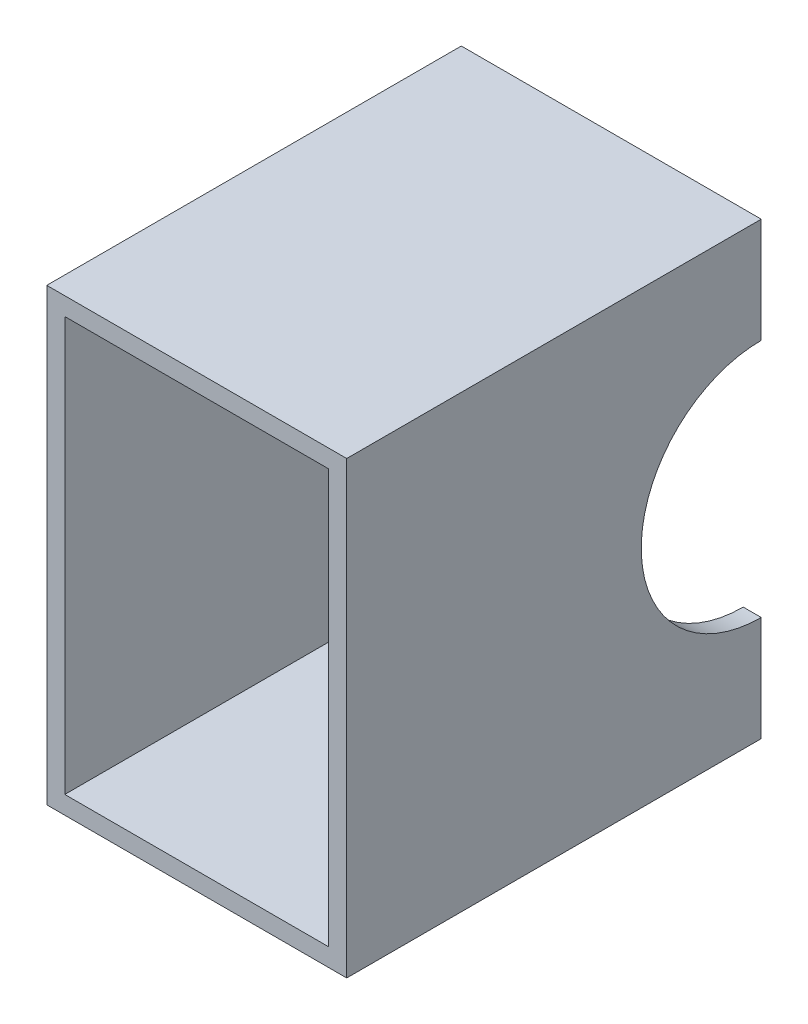
ISO-10303-21;
HEADER;
FILE_DESCRIPTION(('STEP AP214'),'2;1');
FILE_NAME('part.step','',(''),(''),'','','');
FILE_SCHEMA(('AUTOMOTIVE_DESIGN { 1 0 10303 214 1 1 1 1 }'));
ENDSEC;
DATA;
#1=APPLICATION_CONTEXT('core data for automotive mechanical design processes');
#2=APPLICATION_PROTOCOL_DEFINITION('international standard','automotive_design',2000,#1);
#3=PRODUCT_CONTEXT('',#1,'mechanical');
#4=PRODUCT('Part','Part','',(#3));
#5=PRODUCT_RELATED_PRODUCT_CATEGORY('part','',(#4));
#6=PRODUCT_DEFINITION_FORMATION('','',#4);
#7=PRODUCT_DEFINITION_CONTEXT('part definition',#1,'design');
#8=PRODUCT_DEFINITION('design','',#6,#7);
#9=PRODUCT_DEFINITION_SHAPE('','',#8);
#10=(LENGTH_UNIT() NAMED_UNIT(*) SI_UNIT(.MILLI.,.METRE.));
#11=(NAMED_UNIT(*) PLANE_ANGLE_UNIT() SI_UNIT($,.RADIAN.));
#12=(NAMED_UNIT(*) SI_UNIT($,.STERADIAN.) SOLID_ANGLE_UNIT());
#13=UNCERTAINTY_MEASURE_WITH_UNIT(LENGTH_MEASURE(1.E-05),#10,'distance_accuracy_value','');
#14=(GEOMETRIC_REPRESENTATION_CONTEXT(3) GLOBAL_UNCERTAINTY_ASSIGNED_CONTEXT((#13)) GLOBAL_UNIT_ASSIGNED_CONTEXT((#10,
#11,#12)) REPRESENTATION_CONTEXT('',''));
#15=CARTESIAN_POINT('',(0.,0.,0.));
#16=DIRECTION('',(0.,0.,1.));
#17=DIRECTION('',(1.,0.,0.));
#18=AXIS2_PLACEMENT_3D('',#15,#16,#17);
#19=CARTESIAN_POINT('',(0.,0.,0.));
#20=DIRECTION('',(0.,0.,-1.));
#21=DIRECTION('',(-1.,0.,0.));
#22=AXIS2_PLACEMENT_3D('',#19,#20,#21);
#23=PLANE('',#22);
#24=DIRECTION('',(1.,0.,0.));
#25=VECTOR('',#24,1.);
#26=CARTESIAN_POINT('',(-50.,40.,0.));
#27=LINE('',#26,#25);
#28=CARTESIAN_POINT('',(-50.,40.,0.));
#29=VERTEX_POINT('',#28);
#30=CARTESIAN_POINT('',(-44.,40.,0.));
#31=VERTEX_POINT('',#30);
#32=EDGE_CURVE('E53',#29,#31,#27,.T.);
#33=ORIENTED_EDGE('',*,*,#32,.F.);
#34=DIRECTION('',(0.,-1.,0.));
#35=VECTOR('',#34,1.);
#36=CARTESIAN_POINT('',(-50.,-75.,0.));
#37=LINE('',#36,#35);
#38=CARTESIAN_POINT('',(-50.,74.9999999999999,0.));
#39=VERTEX_POINT('',#38);
#40=EDGE_CURVE('E138',#39,#29,#37,.T.);
#41=ORIENTED_EDGE('',*,*,#40,.F.);
#42=DIRECTION('',(-1.,0.,0.));
#43=VECTOR('',#42,1.);
#44=CARTESIAN_POINT('',(-50.,74.9999999999999,0.));
#45=LINE('',#44,#43);
#46=CARTESIAN_POINT('',(50.,75.,0.));
#47=VERTEX_POINT('',#46);
#48=EDGE_CURVE('E161',#47,#39,#45,.T.);
#49=ORIENTED_EDGE('',*,*,#48,.F.);
#50=DIRECTION('',(0.,1.,0.));
#51=VECTOR('',#50,1.);
#52=CARTESIAN_POINT('',(50.,-75.,0.));
#53=LINE('',#52,#51);
#54=CARTESIAN_POINT('',(50.,40.,0.));
#55=VERTEX_POINT('',#54);
#56=EDGE_CURVE('E151',#55,#47,#53,.T.);
#57=ORIENTED_EDGE('',*,*,#56,.F.);
#58=CARTESIAN_POINT('',(44.,40.,0.));
#59=VERTEX_POINT('',#58);
#60=EDGE_CURVE('E141',#59,#55,#27,.T.);
#61=ORIENTED_EDGE('',*,*,#60,.F.);
#62=DIRECTION('',(0.,1.,0.));
#63=VECTOR('',#62,1.);
#64=CARTESIAN_POINT('',(44.,-69.,0.));
#65=LINE('',#64,#63);
#66=CARTESIAN_POINT('',(44.,69.,0.));
#67=VERTEX_POINT('',#66);
#68=EDGE_CURVE('E209',#59,#67,#65,.T.);
#69=ORIENTED_EDGE('',*,*,#68,.T.);
#70=DIRECTION('',(-1.,0.,0.));
#71=VECTOR('',#70,1.);
#72=CARTESIAN_POINT('',(-44.,69.,0.));
#73=LINE('',#72,#71);
#74=CARTESIAN_POINT('',(-44.,69.,0.));
#75=VERTEX_POINT('',#74);
#76=EDGE_CURVE('E202',#67,#75,#73,.T.);
#77=ORIENTED_EDGE('',*,*,#76,.T.);
#78=DIRECTION('',(0.,-1.,0.));
#79=VECTOR('',#78,1.);
#80=CARTESIAN_POINT('',(-44.,-69.,0.));
#81=LINE('',#80,#79);
#82=EDGE_CURVE('E136',#75,#31,#81,.T.);
#83=ORIENTED_EDGE('',*,*,#82,.T.);
#84=EDGE_LOOP('',(#33,#41,#49,#57,#61,#69,#77,#83));
#85=FACE_BOUND('',#84,.T.);
#86=ADVANCED_FACE('F39',(#85),#23,.T.);
#87=CARTESIAN_POINT('',(0.,0.,138.202315188089));
#88=DIRECTION('',(0.,0.,-1.));
#89=DIRECTION('',(-1.,0.,0.));
#90=AXIS2_PLACEMENT_3D('',#87,#88,#89);
#91=PLANE('',#90);
#92=DIRECTION('',(0.,-1.,0.));
#93=VECTOR('',#92,1.);
#94=CARTESIAN_POINT('',(-50.,-75.,138.202315188089));
#95=LINE('',#94,#93);
#96=CARTESIAN_POINT('',(-50.,74.9999999999999,138.202315188089));
#97=VERTEX_POINT('',#96);
#98=CARTESIAN_POINT('',(-50.,-75.,138.202315188089));
#99=VERTEX_POINT('',#98);
#100=EDGE_CURVE('E162',#97,#99,#95,.T.);
#101=ORIENTED_EDGE('',*,*,#100,.T.);
#102=DIRECTION('',(1.,0.,0.));
#103=VECTOR('',#102,1.);
#104=CARTESIAN_POINT('',(-50.,-75.,138.202315188089));
#105=LINE('',#104,#103);
#106=CARTESIAN_POINT('',(50.,-75.,138.202315188089));
#107=VERTEX_POINT('',#106);
#108=EDGE_CURVE('E177',#99,#107,#105,.T.);
#109=ORIENTED_EDGE('',*,*,#108,.T.);
#110=DIRECTION('',(0.,1.,0.));
#111=VECTOR('',#110,1.);
#112=CARTESIAN_POINT('',(50.,-75.,138.202315188089));
#113=LINE('',#112,#111);
#114=CARTESIAN_POINT('',(50.,75.,138.202315188089));
#115=VERTEX_POINT('',#114);
#116=EDGE_CURVE('E190',#107,#115,#113,.T.);
#117=ORIENTED_EDGE('',*,*,#116,.T.);
#118=DIRECTION('',(-1.,0.,0.));
#119=VECTOR('',#118,1.);
#120=CARTESIAN_POINT('',(-50.,74.9999999999999,138.202315188089));
#121=LINE('',#120,#119);
#122=EDGE_CURVE('E154',#115,#97,#121,.T.);
#123=ORIENTED_EDGE('',*,*,#122,.T.);
#124=EDGE_LOOP('',(#101,#109,#117,#123));
#125=FACE_BOUND('',#124,.T.);
#126=DIRECTION('',(0.,-1.,0.));
#127=VECTOR('',#126,1.);
#128=CARTESIAN_POINT('',(-44.,-69.,138.202315188089));
#129=LINE('',#128,#127);
#130=CARTESIAN_POINT('',(-44.,69.,138.202315188089));
#131=VERTEX_POINT('',#130);
#132=CARTESIAN_POINT('',(-44.,-69.,138.202315188089));
#133=VERTEX_POINT('',#132);
#134=EDGE_CURVE('E210',#131,#133,#129,.T.);
#135=ORIENTED_EDGE('',*,*,#134,.F.);
#136=DIRECTION('',(-1.,0.,0.));
#137=VECTOR('',#136,1.);
#138=CARTESIAN_POINT('',(-44.,69.,138.202315188089));
#139=LINE('',#138,#137);
#140=CARTESIAN_POINT('',(44.,69.,138.202315188089));
#141=VERTEX_POINT('',#140);
#142=EDGE_CURVE('E204',#141,#131,#139,.T.);
#143=ORIENTED_EDGE('',*,*,#142,.F.);
#144=DIRECTION('',(0.,1.,0.));
#145=VECTOR('',#144,1.);
#146=CARTESIAN_POINT('',(44.,-69.,138.202315188089));
#147=LINE('',#146,#145);
#148=CARTESIAN_POINT('',(44.,-69.,138.202315188089));
#149=VERTEX_POINT('',#148);
#150=EDGE_CURVE('E216',#149,#141,#147,.T.);
#151=ORIENTED_EDGE('',*,*,#150,.F.);
#152=DIRECTION('',(1.,0.,0.));
#153=VECTOR('',#152,1.);
#154=CARTESIAN_POINT('',(-44.,-69.,138.202315188089));
#155=LINE('',#154,#153);
#156=EDGE_CURVE('E218',#133,#149,#155,.T.);
#157=ORIENTED_EDGE('',*,*,#156,.F.);
#158=EDGE_LOOP('',(#135,#143,#151,#157));
#159=FACE_BOUND('',#158,.T.);
#160=ADVANCED_FACE('F243',(#125,#159),#91,.F.);
#161=DIRECTION('',(1.,0.,0.));
#162=VECTOR('',#161,1.);
#163=CARTESIAN_POINT('',(-50.,-40.,0.));
#164=LINE('',#163,#162);
#165=CARTESIAN_POINT('',(50.,-40.,0.));
#166=VERTEX_POINT('',#165);
#167=CARTESIAN_POINT('',(44.,-40.,0.));
#168=VERTEX_POINT('',#167);
#169=EDGE_CURVE('E64',#166,#168,#164,.F.);
#170=ORIENTED_EDGE('',*,*,#169,.F.);
#171=CARTESIAN_POINT('',(50.,-75.,0.));
#172=VERTEX_POINT('',#171);
#173=EDGE_CURVE('E158',#172,#166,#53,.T.);
#174=ORIENTED_EDGE('',*,*,#173,.F.);
#175=DIRECTION('',(1.,0.,0.));
#176=VECTOR('',#175,1.);
#177=CARTESIAN_POINT('',(-50.,-75.,0.));
#178=LINE('',#177,#176);
#179=CARTESIAN_POINT('',(-50.,-75.,0.));
#180=VERTEX_POINT('',#179);
#181=EDGE_CURVE('E146',#180,#172,#178,.T.);
#182=ORIENTED_EDGE('',*,*,#181,.F.);
#183=CARTESIAN_POINT('',(-50.,-40.,0.));
#184=VERTEX_POINT('',#183);
#185=EDGE_CURVE('E149',#184,#180,#37,.T.);
#186=ORIENTED_EDGE('',*,*,#185,.F.);
#187=CARTESIAN_POINT('',(-44.,-40.,0.));
#188=VERTEX_POINT('',#187);
#189=EDGE_CURVE('E126',#188,#184,#164,.F.);
#190=ORIENTED_EDGE('',*,*,#189,.F.);
#191=CARTESIAN_POINT('',(-44.,-69.,0.));
#192=VERTEX_POINT('',#191);
#193=EDGE_CURVE('E143',#188,#192,#81,.T.);
#194=ORIENTED_EDGE('',*,*,#193,.T.);
#195=DIRECTION('',(1.,0.,0.));
#196=VECTOR('',#195,1.);
#197=CARTESIAN_POINT('',(-44.,-69.,0.));
#198=LINE('',#197,#196);
#199=CARTESIAN_POINT('',(44.,-69.,0.));
#200=VERTEX_POINT('',#199);
#201=EDGE_CURVE('E211',#192,#200,#198,.T.);
#202=ORIENTED_EDGE('',*,*,#201,.T.);
#203=EDGE_CURVE('E208',#200,#168,#65,.T.);
#204=ORIENTED_EDGE('',*,*,#203,.T.);
#205=EDGE_LOOP('',(#170,#174,#182,#186,#190,#194,#202,#204));
#206=FACE_BOUND('',#205,.T.);
#207=ADVANCED_FACE('F176',(#206),#23,.T.);
#208=CARTESIAN_POINT('',(-50.,-75.,138.202315188089));
#209=DIRECTION('',(1.,0.,0.));
#210=DIRECTION('',(0.,1.,0.));
#211=AXIS2_PLACEMENT_3D('',#208,#209,#210);
#212=PLANE('',#211);
#213=ORIENTED_EDGE('',*,*,#40,.T.);
#214=CARTESIAN_POINT('',(-50.,0.,0.));
#215=DIRECTION('',(1.,0.,0.));
#216=DIRECTION('',(0.,0.,-1.));
#217=AXIS2_PLACEMENT_3D('',#214,#215,#216);
#218=CIRCLE('',#217,40.);
#219=EDGE_CURVE('E121',#29,#184,#218,.T.);
#220=ORIENTED_EDGE('',*,*,#219,.T.);
#221=ORIENTED_EDGE('',*,*,#185,.T.);
#222=DIRECTION('',(0.,0.,-1.));
#223=VECTOR('',#222,1.);
#224=CARTESIAN_POINT('',(-50.,-75.,138.202315188089));
#225=LINE('',#224,#223);
#226=EDGE_CURVE('E50',#99,#180,#225,.T.);
#227=ORIENTED_EDGE('',*,*,#226,.F.);
#228=ORIENTED_EDGE('',*,*,#100,.F.);
#229=DIRECTION('',(0.,0.,-1.));
#230=VECTOR('',#229,1.);
#231=CARTESIAN_POINT('',(-50.,74.9999999999999,138.202315188089));
#232=LINE('',#231,#230);
#233=EDGE_CURVE('E150',#97,#39,#232,.T.);
#234=ORIENTED_EDGE('',*,*,#233,.T.);
#235=EDGE_LOOP('',(#213,#220,#221,#227,#228,#234));
#236=FACE_BOUND('',#235,.T.);
#237=ADVANCED_FACE('F41',(#236),#212,.F.);
#238=CARTESIAN_POINT('',(-50.,-75.,138.202315188089));
#239=DIRECTION('',(0.,1.,0.));
#240=DIRECTION('',(0.,0.,1.));
#241=AXIS2_PLACEMENT_3D('',#238,#239,#240);
#242=PLANE('',#241);
#243=ORIENTED_EDGE('',*,*,#181,.T.);
#244=DIRECTION('',(0.,0.,-1.));
#245=VECTOR('',#244,1.);
#246=CARTESIAN_POINT('',(50.,-75.,138.202315188089));
#247=LINE('',#246,#245);
#248=EDGE_CURVE('E169',#107,#172,#247,.T.);
#249=ORIENTED_EDGE('',*,*,#248,.F.);
#250=ORIENTED_EDGE('',*,*,#108,.F.);
#251=ORIENTED_EDGE('',*,*,#226,.T.);
#252=EDGE_LOOP('',(#243,#249,#250,#251));
#253=FACE_BOUND('',#252,.T.);
#254=ADVANCED_FACE('F175',(#253),#242,.F.);
#255=CARTESIAN_POINT('',(50.,-75.,138.202315188089));
#256=DIRECTION('',(-1.,0.,0.));
#257=DIRECTION('',(0.,-1.,0.));
#258=AXIS2_PLACEMENT_3D('',#255,#256,#257);
#259=PLANE('',#258);
#260=ORIENTED_EDGE('',*,*,#173,.T.);
#261=CARTESIAN_POINT('',(50.,0.,0.));
#262=DIRECTION('',(1.,0.,0.));
#263=DIRECTION('',(0.,0.,-1.));
#264=AXIS2_PLACEMENT_3D('',#261,#262,#263);
#265=CIRCLE('',#264,40.);
#266=EDGE_CURVE('E131',#55,#166,#265,.T.);
#267=ORIENTED_EDGE('',*,*,#266,.F.);
#268=ORIENTED_EDGE('',*,*,#56,.T.);
#269=DIRECTION('',(0.,0.,-1.));
#270=VECTOR('',#269,1.);
#271=CARTESIAN_POINT('',(50.,75.,138.202315188089));
#272=LINE('',#271,#270);
#273=EDGE_CURVE('E164',#115,#47,#272,.T.);
#274=ORIENTED_EDGE('',*,*,#273,.F.);
#275=ORIENTED_EDGE('',*,*,#116,.F.);
#276=ORIENTED_EDGE('',*,*,#248,.T.);
#277=EDGE_LOOP('',(#260,#267,#268,#274,#275,#276));
#278=FACE_BOUND('',#277,.T.);
#279=ADVANCED_FACE('F184',(#278),#259,.F.);
#280=CARTESIAN_POINT('',(-50.,74.9999999999999,138.202315188089));
#281=DIRECTION('',(0.,-1.,0.));
#282=DIRECTION('',(1.,0.,0.));
#283=AXIS2_PLACEMENT_3D('',#280,#281,#282);
#284=PLANE('',#283);
#285=ORIENTED_EDGE('',*,*,#48,.T.);
#286=ORIENTED_EDGE('',*,*,#233,.F.);
#287=ORIENTED_EDGE('',*,*,#122,.F.);
#288=ORIENTED_EDGE('',*,*,#273,.T.);
#289=EDGE_LOOP('',(#285,#286,#287,#288));
#290=FACE_BOUND('',#289,.T.);
#291=ADVANCED_FACE('F256',(#290),#284,.F.);
#292=CARTESIAN_POINT('',(-44.,-69.,138.202315188089));
#293=DIRECTION('',(1.,0.,0.));
#294=DIRECTION('',(0.,0.,-1.));
#295=AXIS2_PLACEMENT_3D('',#292,#293,#294);
#296=PLANE('',#295);
#297=CARTESIAN_POINT('',(-44.,0.,0.));
#298=DIRECTION('',(1.,0.,0.));
#299=DIRECTION('',(0.,0.,-1.));
#300=AXIS2_PLACEMENT_3D('',#297,#298,#299);
#301=CIRCLE('',#300,40.);
#302=EDGE_CURVE('E225',#31,#188,#301,.T.);
#303=ORIENTED_EDGE('',*,*,#302,.F.);
#304=ORIENTED_EDGE('',*,*,#82,.F.);
#305=DIRECTION('',(0.,0.,-1.));
#306=VECTOR('',#305,1.);
#307=CARTESIAN_POINT('',(-44.,69.,138.202315188089));
#308=LINE('',#307,#306);
#309=EDGE_CURVE('E203',#131,#75,#308,.T.);
#310=ORIENTED_EDGE('',*,*,#309,.F.);
#311=ORIENTED_EDGE('',*,*,#134,.T.);
#312=DIRECTION('',(0.,0.,-1.));
#313=VECTOR('',#312,1.);
#314=CARTESIAN_POINT('',(-44.,-69.,138.202315188089));
#315=LINE('',#314,#313);
#316=EDGE_CURVE('E153',#133,#192,#315,.T.);
#317=ORIENTED_EDGE('',*,*,#316,.T.);
#318=ORIENTED_EDGE('',*,*,#193,.F.);
#319=EDGE_LOOP('',(#303,#304,#310,#311,#317,#318));
#320=FACE_BOUND('',#319,.T.);
#321=ADVANCED_FACE('F238',(#320),#296,.T.);
#322=CARTESIAN_POINT('',(-44.,-69.,138.202315188089));
#323=DIRECTION('',(0.,1.,0.));
#324=DIRECTION('',(0.,0.,1.));
#325=AXIS2_PLACEMENT_3D('',#322,#323,#324);
#326=PLANE('',#325);
#327=ORIENTED_EDGE('',*,*,#201,.F.);
#328=ORIENTED_EDGE('',*,*,#316,.F.);
#329=ORIENTED_EDGE('',*,*,#156,.T.);
#330=DIRECTION('',(0.,0.,-1.));
#331=VECTOR('',#330,1.);
#332=CARTESIAN_POINT('',(44.,-69.,138.202315188089));
#333=LINE('',#332,#331);
#334=EDGE_CURVE('E198',#149,#200,#333,.T.);
#335=ORIENTED_EDGE('',*,*,#334,.T.);
#336=EDGE_LOOP('',(#327,#328,#329,#335));
#337=FACE_BOUND('',#336,.T.);
#338=ADVANCED_FACE('F250',(#337),#326,.T.);
#339=CARTESIAN_POINT('',(44.,-69.,138.202315188089));
#340=DIRECTION('',(-1.,0.,0.));
#341=DIRECTION('',(0.,0.,1.));
#342=AXIS2_PLACEMENT_3D('',#339,#340,#341);
#343=PLANE('',#342);
#344=CARTESIAN_POINT('',(44.,0.,0.));
#345=DIRECTION('',(-1.,0.,0.));
#346=DIRECTION('',(0.,0.,1.));
#347=AXIS2_PLACEMENT_3D('',#344,#345,#346);
#348=CIRCLE('',#347,40.);
#349=EDGE_CURVE('E11',#168,#59,#348,.T.);
#350=ORIENTED_EDGE('',*,*,#349,.F.);
#351=ORIENTED_EDGE('',*,*,#203,.F.);
#352=ORIENTED_EDGE('',*,*,#334,.F.);
#353=ORIENTED_EDGE('',*,*,#150,.T.);
#354=DIRECTION('',(0.,0.,-1.));
#355=VECTOR('',#354,1.);
#356=CARTESIAN_POINT('',(44.,69.,138.202315188089));
#357=LINE('',#356,#355);
#358=EDGE_CURVE('E196',#141,#67,#357,.T.);
#359=ORIENTED_EDGE('',*,*,#358,.T.);
#360=ORIENTED_EDGE('',*,*,#68,.F.);
#361=EDGE_LOOP('',(#350,#351,#352,#353,#359,#360));
#362=FACE_BOUND('',#361,.T.);
#363=ADVANCED_FACE('F228',(#362),#343,.T.);
#364=CARTESIAN_POINT('',(-44.,69.,138.202315188089));
#365=DIRECTION('',(0.,-1.,0.));
#366=DIRECTION('',(0.,0.,-1.));
#367=AXIS2_PLACEMENT_3D('',#364,#365,#366);
#368=PLANE('',#367);
#369=ORIENTED_EDGE('',*,*,#76,.F.);
#370=ORIENTED_EDGE('',*,*,#358,.F.);
#371=ORIENTED_EDGE('',*,*,#142,.T.);
#372=ORIENTED_EDGE('',*,*,#309,.T.);
#373=EDGE_LOOP('',(#369,#370,#371,#372));
#374=FACE_BOUND('',#373,.T.);
#375=ADVANCED_FACE('F237',(#374),#368,.T.);
#376=CARTESIAN_POINT('',(-50.,0.,0.));
#377=DIRECTION('',(1.,0.,0.));
#378=DIRECTION('',(0.,0.,-1.));
#379=AXIS2_PLACEMENT_3D('',#376,#377,#378);
#380=CYLINDRICAL_SURFACE('',#379,40.);
#381=ORIENTED_EDGE('',*,*,#60,.T.);
#382=ORIENTED_EDGE('',*,*,#266,.T.);
#383=ORIENTED_EDGE('',*,*,#169,.T.);
#384=ORIENTED_EDGE('',*,*,#349,.T.);
#385=EDGE_LOOP('',(#381,#382,#383,#384));
#386=FACE_BOUND('',#385,.T.);
#387=ADVANCED_FACE('F223',(#386),#380,.F.);
#388=ORIENTED_EDGE('',*,*,#32,.T.);
#389=ORIENTED_EDGE('',*,*,#302,.T.);
#390=ORIENTED_EDGE('',*,*,#189,.T.);
#391=ORIENTED_EDGE('',*,*,#219,.F.);
#392=EDGE_LOOP('',(#388,#389,#390,#391));
#393=FACE_BOUND('',#392,.T.);
#394=ADVANCED_FACE('F127',(#393),#380,.F.);
#395=CLOSED_SHELL('',(#86,#160,#207,#237,#254,#279,#291,#321,#338,#363,#375,#387,#394));
#396=MANIFOLD_SOLID_BREP('B2',#395);
#397=ADVANCED_BREP_SHAPE_REPRESENTATION('',(#18,#396),#14);
#398=SHAPE_DEFINITION_REPRESENTATION(#9,#397);
ENDSEC;
END-ISO-10303-21;
